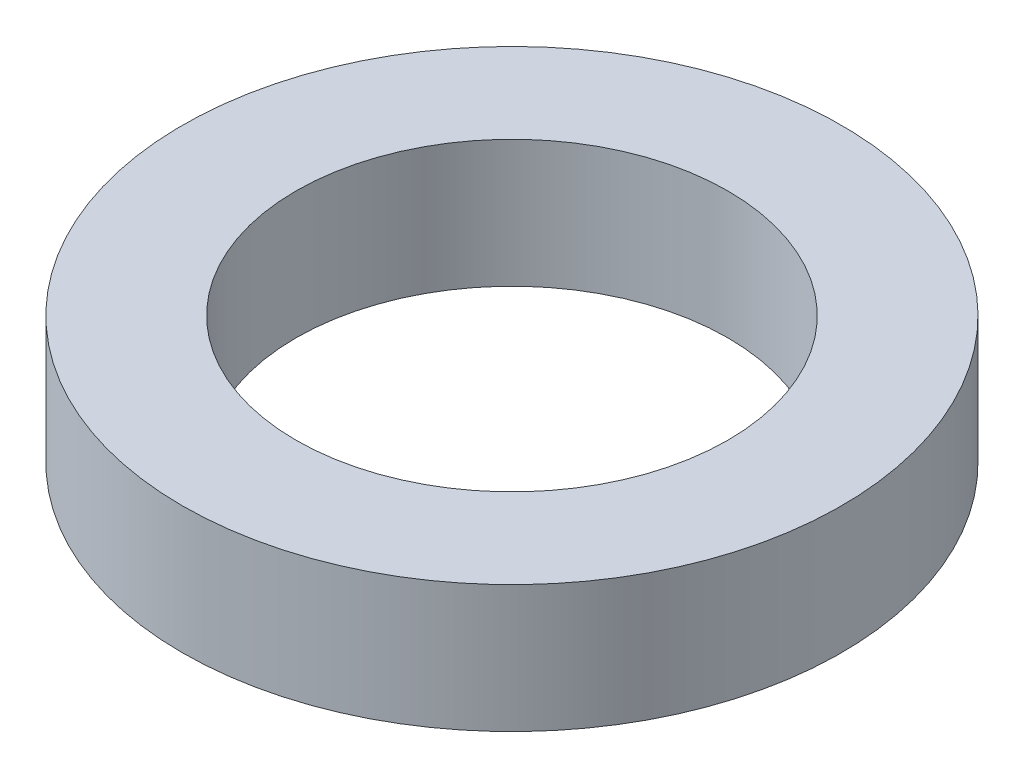
ISO-10303-21;
HEADER;
FILE_DESCRIPTION(('STEP AP214'),'2;1');
FILE_NAME('part.step','',(''),(''),'','','');
FILE_SCHEMA(('AUTOMOTIVE_DESIGN { 1 0 10303 214 1 1 1 1 }'));
ENDSEC;
DATA;
#1=APPLICATION_CONTEXT('core data for automotive mechanical design processes');
#2=APPLICATION_PROTOCOL_DEFINITION('international standard','automotive_design',2000,#1);
#3=PRODUCT_CONTEXT('',#1,'mechanical');
#4=PRODUCT('Part','Part','',(#3));
#5=PRODUCT_RELATED_PRODUCT_CATEGORY('part','',(#4));
#6=PRODUCT_DEFINITION_FORMATION('','',#4);
#7=PRODUCT_DEFINITION_CONTEXT('part definition',#1,'design');
#8=PRODUCT_DEFINITION('design','',#6,#7);
#9=PRODUCT_DEFINITION_SHAPE('','',#8);
#10=(LENGTH_UNIT() NAMED_UNIT(*) SI_UNIT(.MILLI.,.METRE.));
#11=(NAMED_UNIT(*) PLANE_ANGLE_UNIT() SI_UNIT($,.RADIAN.));
#12=(NAMED_UNIT(*) SI_UNIT($,.STERADIAN.) SOLID_ANGLE_UNIT());
#13=UNCERTAINTY_MEASURE_WITH_UNIT(LENGTH_MEASURE(1.E-05),#10,'distance_accuracy_value','');
#14=(GEOMETRIC_REPRESENTATION_CONTEXT(3) GLOBAL_UNCERTAINTY_ASSIGNED_CONTEXT((#13)) GLOBAL_UNIT_ASSIGNED_CONTEXT((#10,
#11,#12)) REPRESENTATION_CONTEXT('',''));
#15=CARTESIAN_POINT('',(0.,0.,0.));
#16=DIRECTION('',(0.,0.,1.));
#17=DIRECTION('',(1.,0.,0.));
#18=AXIS2_PLACEMENT_3D('',#15,#16,#17);
#19=CARTESIAN_POINT('',(0.,28.,0.));
#20=DIRECTION('',(0.,-1.,0.));
#21=DIRECTION('',(0.,0.,-1.));
#22=AXIS2_PLACEMENT_3D('',#19,#20,#21);
#23=CYLINDRICAL_SURFACE('',#22,72.5);
#24=CARTESIAN_POINT('',(0.,28.,0.));
#25=DIRECTION('',(0.,1.,0.));
#26=DIRECTION('',(0.,0.,1.));
#27=AXIS2_PLACEMENT_3D('',#24,#25,#26);
#28=CIRCLE('',#27,72.5);
#29=CARTESIAN_POINT('',(0.,28.,72.5));
#30=VERTEX_POINT('',#29);
#31=EDGE_CURVE('E10',#30,#30,#28,.T.);
#32=ORIENTED_EDGE('',*,*,#31,.F.);
#33=EDGE_LOOP('',(#32));
#34=FACE_BOUND('',#33,.T.);
#35=CARTESIAN_POINT('',(0.,0.,0.));
#36=DIRECTION('',(0.,1.,0.));
#37=DIRECTION('',(0.,0.,1.));
#38=AXIS2_PLACEMENT_3D('',#35,#36,#37);
#39=CIRCLE('',#38,72.5);
#40=CARTESIAN_POINT('',(0.,0.,72.5));
#41=VERTEX_POINT('',#40);
#42=EDGE_CURVE('E37',#41,#41,#39,.T.);
#43=ORIENTED_EDGE('',*,*,#42,.T.);
#44=EDGE_LOOP('',(#43));
#45=FACE_BOUND('',#44,.T.);
#46=ADVANCED_FACE('F40',(#34,#45),#23,.T.);
#47=CARTESIAN_POINT('',(0.,28.,0.));
#48=DIRECTION('',(0.,1.,0.));
#49=DIRECTION('',(0.,0.,1.));
#50=AXIS2_PLACEMENT_3D('',#47,#48,#49);
#51=PLANE('',#50);
#52=CARTESIAN_POINT('',(0.,28.,0.));
#53=DIRECTION('',(0.,1.,0.));
#54=DIRECTION('',(0.,0.,1.));
#55=AXIS2_PLACEMENT_3D('',#52,#53,#54);
#56=CIRCLE('',#55,47.5);
#57=CARTESIAN_POINT('',(0.,28.,47.5));
#58=VERTEX_POINT('',#57);
#59=EDGE_CURVE('E50',#58,#58,#56,.T.);
#60=ORIENTED_EDGE('',*,*,#59,.F.);
#61=EDGE_LOOP('',(#60));
#62=FACE_BOUND('',#61,.T.);
#63=ORIENTED_EDGE('',*,*,#31,.T.);
#64=EDGE_LOOP('',(#63));
#65=FACE_BOUND('',#64,.T.);
#66=ADVANCED_FACE('F59',(#62,#65),#51,.T.);
#67=CARTESIAN_POINT('',(0.,0.,0.));
#68=DIRECTION('',(0.,1.,0.));
#69=DIRECTION('',(0.,0.,1.));
#70=AXIS2_PLACEMENT_3D('',#67,#68,#69);
#71=PLANE('',#70);
#72=CARTESIAN_POINT('',(0.,0.,0.));
#73=DIRECTION('',(0.,1.,0.));
#74=DIRECTION('',(0.,0.,1.));
#75=AXIS2_PLACEMENT_3D('',#72,#73,#74);
#76=CIRCLE('',#75,47.5);
#77=CARTESIAN_POINT('',(0.,0.,47.5));
#78=VERTEX_POINT('',#77);
#79=EDGE_CURVE('E47',#78,#78,#76,.T.);
#80=ORIENTED_EDGE('',*,*,#79,.T.);
#81=EDGE_LOOP('',(#80));
#82=FACE_BOUND('',#81,.T.);
#83=ORIENTED_EDGE('',*,*,#42,.F.);
#84=EDGE_LOOP('',(#83));
#85=FACE_BOUND('',#84,.T.);
#86=ADVANCED_FACE('F58',(#82,#85),#71,.F.);
#87=CARTESIAN_POINT('',(0.,28.,0.));
#88=DIRECTION('',(0.,-1.,0.));
#89=DIRECTION('',(0.,0.,-1.));
#90=AXIS2_PLACEMENT_3D('',#87,#88,#89);
#91=CYLINDRICAL_SURFACE('',#90,47.5);
#92=ORIENTED_EDGE('',*,*,#59,.T.);
#93=EDGE_LOOP('',(#92));
#94=FACE_BOUND('',#93,.T.);
#95=ORIENTED_EDGE('',*,*,#79,.F.);
#96=EDGE_LOOP('',(#95));
#97=FACE_BOUND('',#96,.T.);
#98=ADVANCED_FACE('F54',(#94,#97),#91,.F.);
#99=CLOSED_SHELL('',(#46,#66,#86,#98));
#100=MANIFOLD_SOLID_BREP('B2',#99);
#101=ADVANCED_BREP_SHAPE_REPRESENTATION('',(#18,#100),#14);
#102=SHAPE_DEFINITION_REPRESENTATION(#9,#101);
ENDSEC;
END-ISO-10303-21;
